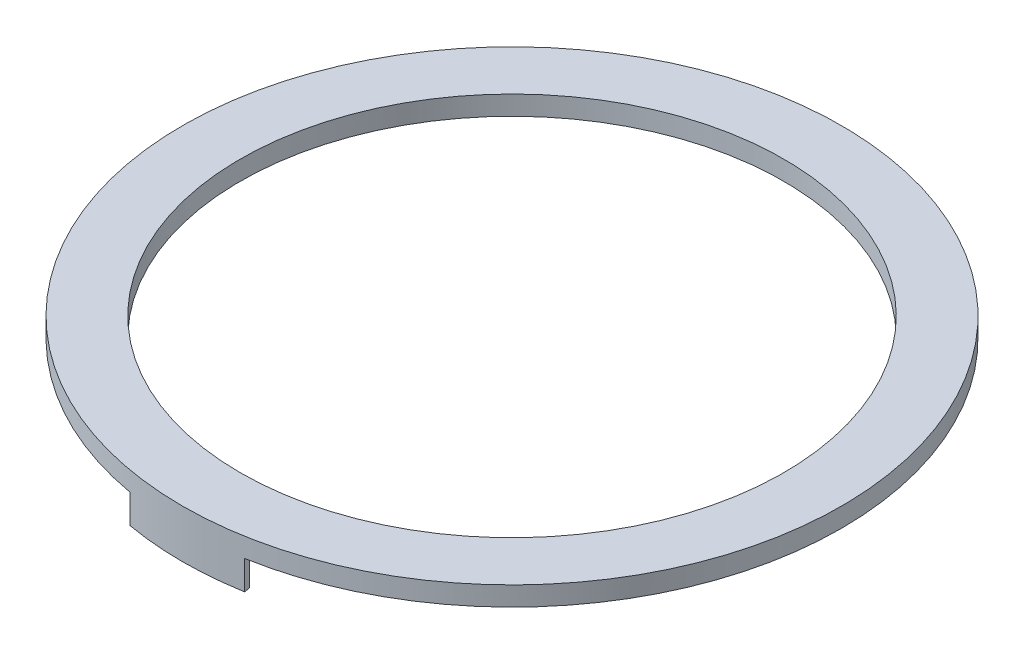
ISO-10303-21;
HEADER;
FILE_DESCRIPTION(('STEP AP214'),'2;1');
FILE_NAME('part.step','',(''),(''),'','','');
FILE_SCHEMA(('AUTOMOTIVE_DESIGN { 1 0 10303 214 1 1 1 1 }'));
ENDSEC;
DATA;
#1=APPLICATION_CONTEXT('core data for automotive mechanical design processes');
#2=APPLICATION_PROTOCOL_DEFINITION('international standard','automotive_design',2000,#1);
#3=PRODUCT_CONTEXT('',#1,'mechanical');
#4=PRODUCT('Part','Part','',(#3));
#5=PRODUCT_RELATED_PRODUCT_CATEGORY('part','',(#4));
#6=PRODUCT_DEFINITION_FORMATION('','',#4);
#7=PRODUCT_DEFINITION_CONTEXT('part definition',#1,'design');
#8=PRODUCT_DEFINITION('design','',#6,#7);
#9=PRODUCT_DEFINITION_SHAPE('','',#8);
#10=(LENGTH_UNIT() NAMED_UNIT(*) SI_UNIT(.MILLI.,.METRE.));
#11=(NAMED_UNIT(*) PLANE_ANGLE_UNIT() SI_UNIT($,.RADIAN.));
#12=(NAMED_UNIT(*) SI_UNIT($,.STERADIAN.) SOLID_ANGLE_UNIT());
#13=UNCERTAINTY_MEASURE_WITH_UNIT(LENGTH_MEASURE(1.E-05),#10,'distance_accuracy_value','');
#14=(GEOMETRIC_REPRESENTATION_CONTEXT(3) GLOBAL_UNCERTAINTY_ASSIGNED_CONTEXT((#13)) GLOBAL_UNIT_ASSIGNED_CONTEXT((#10,
#11,#12)) REPRESENTATION_CONTEXT('',''));
#15=CARTESIAN_POINT('',(0.,0.,0.));
#16=DIRECTION('',(0.,0.,1.));
#17=DIRECTION('',(1.,0.,0.));
#18=AXIS2_PLACEMENT_3D('',#15,#16,#17);
#19=CARTESIAN_POINT('',(0.,0.,0.));
#20=DIRECTION('',(0.,1.,0.));
#21=DIRECTION('',(0.,0.,1.));
#22=AXIS2_PLACEMENT_3D('',#19,#20,#21);
#23=PLANE('',#22);
#24=CARTESIAN_POINT('',(0.,0.,0.));
#25=DIRECTION('',(0.,1.,0.));
#26=DIRECTION('',(0.,0.,1.));
#27=AXIS2_PLACEMENT_3D('',#24,#25,#26);
#28=CIRCLE('',#27,141.);
#29=CARTESIAN_POINT('',(0.,0.,141.));
#30=VERTEX_POINT('',#29);
#31=EDGE_CURVE('E199',#30,#30,#28,.T.);
#32=ORIENTED_EDGE('',*,*,#31,.T.);
#33=EDGE_LOOP('',(#32));
#34=FACE_BOUND('',#33,.T.);
#35=DIRECTION('',(-0.135063024510571,0.,-0.990837009507647));
#36=VECTOR('',#35,1.);
#37=CARTESIAN_POINT('',(-29.2699838194134,0.,-165.430553548041));
#38=LINE('',#37,#36);
#39=CARTESIAN_POINT('',(-29.2699838194134,0.,-165.430553548041));
#40=VERTEX_POINT('',#39);
#41=CARTESIAN_POINT('',(-29.6754858921811,0.,-168.405360772937));
#42=VERTEX_POINT('',#41);
#43=EDGE_CURVE('E61',#40,#42,#38,.T.);
#44=ORIENTED_EDGE('',*,*,#43,.F.);
#45=CARTESIAN_POINT('',(0.,0.,0.));
#46=DIRECTION('',(0.,1.,0.));
#47=DIRECTION('',(0.,0.,1.));
#48=AXIS2_PLACEMENT_3D('',#45,#46,#47);
#49=CIRCLE('',#48,168.);
#50=CARTESIAN_POINT('',(29.1206392453004,0.,-165.456907894307));
#51=VERTEX_POINT('',#50);
#52=EDGE_CURVE('E137',#51,#40,#49,.T.);
#53=ORIENTED_EDGE('',*,*,#52,.F.);
#54=DIRECTION('',(-0.197126989575285,0.,0.980377962818925));
#55=VECTOR('',#54,1.);
#56=CARTESIAN_POINT('',(29.7121905172474,0.,-168.398888757221));
#57=LINE('',#56,#55);
#58=CARTESIAN_POINT('',(29.7121905172474,0.,-168.398888757221));
#59=VERTEX_POINT('',#58);
#60=EDGE_CURVE('E126',#59,#51,#57,.T.);
#61=ORIENTED_EDGE('',*,*,#60,.F.);
#62=CARTESIAN_POINT('',(0.,0.,0.));
#63=DIRECTION('',(0.,1.,0.));
#64=DIRECTION('',(0.,0.,1.));
#65=AXIS2_PLACEMENT_3D('',#62,#63,#64);
#66=CIRCLE('',#65,171.);
#67=CARTESIAN_POINT('',(29.6938383810537,0.,168.402125765086));
#68=VERTEX_POINT('',#67);
#69=EDGE_CURVE('E49',#68,#59,#66,.T.);
#70=ORIENTED_EDGE('',*,*,#69,.F.);
#71=DIRECTION('',(-0.173648177666982,0.,-0.984807753012199));
#72=VECTOR('',#71,1.);
#73=CARTESIAN_POINT('',(29.6938383810537,0.,168.402125765086));
#74=LINE('',#73,#72);
#75=CARTESIAN_POINT('',(29.1728938480527,0.,165.44770250605));
#76=VERTEX_POINT('',#75);
#77=EDGE_CURVE('E152',#68,#76,#74,.T.);
#78=ORIENTED_EDGE('',*,*,#77,.T.);
#79=CARTESIAN_POINT('',(0.,0.,0.));
#80=DIRECTION('',(0.,-1.,0.));
#81=DIRECTION('',(0.,0.,-1.));
#82=AXIS2_PLACEMENT_3D('',#79,#80,#81);
#83=CIRCLE('',#82,168.);
#84=CARTESIAN_POINT('',(-29.0797455051383,0.,165.464100037913));
#85=VERTEX_POINT('',#84);
#86=EDGE_CURVE('E162',#76,#85,#83,.T.);
#87=ORIENTED_EDGE('',*,*,#86,.T.);
#88=DIRECTION('',(0.216721423358504,0.,-0.976233488801457));
#89=VECTOR('',#88,1.);
#90=CARTESIAN_POINT('',(-29.730542300579,0.,168.395649749373));
#91=LINE('',#90,#89);
#92=CARTESIAN_POINT('',(-29.730542300579,0.,168.395649749373));
#93=VERTEX_POINT('',#92);
#94=EDGE_CURVE('E177',#93,#85,#91,.T.);
#95=ORIENTED_EDGE('',*,*,#94,.F.);
#96=EDGE_CURVE('E66',#42,#93,#66,.T.);
#97=ORIENTED_EDGE('',*,*,#96,.F.);
#98=EDGE_LOOP('',(#44,#53,#61,#70,#78,#87,#95,#97));
#99=FACE_BOUND('',#98,.T.);
#100=ADVANCED_FACE('F45',(#34,#99),#23,.F.);
#101=CARTESIAN_POINT('',(0.,10.,0.));
#102=DIRECTION('',(0.,-1.,0.));
#103=DIRECTION('',(0.,0.,-1.));
#104=AXIS2_PLACEMENT_3D('',#101,#102,#103);
#105=CYLINDRICAL_SURFACE('',#104,171.);
#106=CARTESIAN_POINT('',(0.,10.,0.));
#107=DIRECTION('',(0.,1.,0.));
#108=DIRECTION('',(0.,0.,1.));
#109=AXIS2_PLACEMENT_3D('',#106,#107,#108);
#110=CIRCLE('',#109,171.);
#111=CARTESIAN_POINT('',(0.,10.,171.));
#112=VERTEX_POINT('',#111);
#113=EDGE_CURVE('E11',#112,#112,#110,.T.);
#114=ORIENTED_EDGE('',*,*,#113,.F.);
#115=EDGE_LOOP('',(#114));
#116=FACE_BOUND('',#115,.T.);
#117=ORIENTED_EDGE('',*,*,#69,.T.);
#118=DIRECTION('',(0.,1.,0.));
#119=VECTOR('',#118,1.);
#120=CARTESIAN_POINT('',(29.7121905172474,-15.,-168.398888757221));
#121=LINE('',#120,#119);
#122=CARTESIAN_POINT('',(29.7121905172474,-15.,-168.398888757221));
#123=VERTEX_POINT('',#122);
#124=EDGE_CURVE('E129',#123,#59,#121,.T.);
#125=ORIENTED_EDGE('',*,*,#124,.F.);
#126=CARTESIAN_POINT('',(0.,-15.,0.));
#127=DIRECTION('',(0.,-1.,0.));
#128=DIRECTION('',(0.,0.,-1.));
#129=AXIS2_PLACEMENT_3D('',#126,#127,#128);
#130=CIRCLE('',#129,171.);
#131=CARTESIAN_POINT('',(-29.6754858921811,-15.,-168.405360772937));
#132=VERTEX_POINT('',#131);
#133=EDGE_CURVE('E116',#132,#123,#130,.T.);
#134=ORIENTED_EDGE('',*,*,#133,.F.);
#135=DIRECTION('',(0.,1.,0.));
#136=VECTOR('',#135,1.);
#137=CARTESIAN_POINT('',(-29.6754858921811,-15.,-168.405360772937));
#138=LINE('',#137,#136);
#139=EDGE_CURVE('E153',#132,#42,#138,.T.);
#140=ORIENTED_EDGE('',*,*,#139,.T.);
#141=ORIENTED_EDGE('',*,*,#96,.T.);
#142=DIRECTION('',(0.,1.,0.));
#143=VECTOR('',#142,1.);
#144=CARTESIAN_POINT('',(-29.730542300579,-15.,168.395649749373));
#145=LINE('',#144,#143);
#146=CARTESIAN_POINT('',(-29.730542300579,-15.,168.395649749373));
#147=VERTEX_POINT('',#146);
#148=EDGE_CURVE('E186',#147,#93,#145,.T.);
#149=ORIENTED_EDGE('',*,*,#148,.F.);
#150=CARTESIAN_POINT('',(0.,-15.,0.));
#151=DIRECTION('',(0.,1.,0.));
#152=DIRECTION('',(0.,0.,1.));
#153=AXIS2_PLACEMENT_3D('',#150,#151,#152);
#154=CIRCLE('',#153,171.);
#155=CARTESIAN_POINT('',(29.6938383810537,-15.,168.402125765086));
#156=VERTEX_POINT('',#155);
#157=EDGE_CURVE('E166',#147,#156,#154,.T.);
#158=ORIENTED_EDGE('',*,*,#157,.T.);
#159=DIRECTION('',(0.,1.,0.));
#160=VECTOR('',#159,1.);
#161=CARTESIAN_POINT('',(29.6938383810537,-15.,168.402125765086));
#162=LINE('',#161,#160);
#163=EDGE_CURVE('E190',#156,#68,#162,.T.);
#164=ORIENTED_EDGE('',*,*,#163,.T.);
#165=EDGE_LOOP('',(#117,#125,#134,#140,#141,#149,#158,#164));
#166=FACE_BOUND('',#165,.T.);
#167=ADVANCED_FACE('F47',(#116,#166),#105,.T.);
#168=CARTESIAN_POINT('',(0.,10.,0.));
#169=DIRECTION('',(0.,1.,0.));
#170=DIRECTION('',(0.,0.,1.));
#171=AXIS2_PLACEMENT_3D('',#168,#169,#170);
#172=PLANE('',#171);
#173=CARTESIAN_POINT('',(0.,10.,0.));
#174=DIRECTION('',(0.,1.,0.));
#175=DIRECTION('',(0.,0.,1.));
#176=AXIS2_PLACEMENT_3D('',#173,#174,#175);
#177=CIRCLE('',#176,141.);
#178=CARTESIAN_POINT('',(0.,10.,141.));
#179=VERTEX_POINT('',#178);
#180=EDGE_CURVE('E198',#179,#179,#177,.T.);
#181=ORIENTED_EDGE('',*,*,#180,.F.);
#182=EDGE_LOOP('',(#181));
#183=FACE_BOUND('',#182,.T.);
#184=ORIENTED_EDGE('',*,*,#113,.T.);
#185=EDGE_LOOP('',(#184));
#186=FACE_BOUND('',#185,.T.);
#187=ADVANCED_FACE('F209',(#183,#186),#172,.T.);
#188=CARTESIAN_POINT('',(0.,0.,0.));
#189=DIRECTION('',(0.,1.,0.));
#190=DIRECTION('',(0.,0.,1.));
#191=AXIS2_PLACEMENT_3D('',#188,#189,#190);
#192=CYLINDRICAL_SURFACE('',#191,141.);
#193=ORIENTED_EDGE('',*,*,#31,.F.);
#194=EDGE_LOOP('',(#193));
#195=FACE_BOUND('',#194,.T.);
#196=ORIENTED_EDGE('',*,*,#180,.T.);
#197=EDGE_LOOP('',(#196));
#198=FACE_BOUND('',#197,.T.);
#199=ADVANCED_FACE('F207',(#195,#198),#192,.F.);
#200=CARTESIAN_POINT('',(29.6938383810537,-15.,168.402125765086));
#201=DIRECTION('',(0.984807753012199,0.,-0.173648177666982));
#202=DIRECTION('',(-0.173648177666982,0.,-0.984807753012199));
#203=AXIS2_PLACEMENT_3D('',#200,#201,#202);
#204=PLANE('',#203);
#205=ORIENTED_EDGE('',*,*,#77,.F.);
#206=ORIENTED_EDGE('',*,*,#163,.F.);
#207=DIRECTION('',(-0.173648177666982,0.,-0.984807753012199));
#208=VECTOR('',#207,1.);
#209=CARTESIAN_POINT('',(29.6938383810537,-15.,168.402125765086));
#210=LINE('',#209,#208);
#211=CARTESIAN_POINT('',(29.1728938480527,-15.,165.44770250605));
#212=VERTEX_POINT('',#211);
#213=EDGE_CURVE('E161',#156,#212,#210,.T.);
#214=ORIENTED_EDGE('',*,*,#213,.T.);
#215=DIRECTION('',(0.,1.,0.));
#216=VECTOR('',#215,1.);
#217=CARTESIAN_POINT('',(29.1728938480527,-15.,165.44770250605));
#218=LINE('',#217,#216);
#219=EDGE_CURVE('E194',#212,#76,#218,.T.);
#220=ORIENTED_EDGE('',*,*,#219,.T.);
#221=EDGE_LOOP('',(#205,#206,#214,#220));
#222=FACE_BOUND('',#221,.T.);
#223=ADVANCED_FACE('F233',(#222),#204,.T.);
#224=CARTESIAN_POINT('',(-29.730542300579,-15.,168.395649749373));
#225=DIRECTION('',(0.976233488801457,0.,0.216721423358504));
#226=DIRECTION('',(0.216721423358504,0.,-0.976233488801457));
#227=AXIS2_PLACEMENT_3D('',#224,#225,#226);
#228=PLANE('',#227);
#229=ORIENTED_EDGE('',*,*,#94,.T.);
#230=DIRECTION('',(0.,1.,0.));
#231=VECTOR('',#230,1.);
#232=CARTESIAN_POINT('',(-29.0797455051383,-15.,165.464100037913));
#233=LINE('',#232,#231);
#234=CARTESIAN_POINT('',(-29.0797455051383,-15.,165.464100037913));
#235=VERTEX_POINT('',#234);
#236=EDGE_CURVE('E174',#235,#85,#233,.T.);
#237=ORIENTED_EDGE('',*,*,#236,.F.);
#238=DIRECTION('',(0.216721423358504,0.,-0.976233488801457));
#239=VECTOR('',#238,1.);
#240=CARTESIAN_POINT('',(-29.730542300579,-15.,168.395649749373));
#241=LINE('',#240,#239);
#242=EDGE_CURVE('E170',#147,#235,#241,.T.);
#243=ORIENTED_EDGE('',*,*,#242,.F.);
#244=ORIENTED_EDGE('',*,*,#148,.T.);
#245=EDGE_LOOP('',(#229,#237,#243,#244));
#246=FACE_BOUND('',#245,.T.);
#247=ADVANCED_FACE('F227',(#246),#228,.F.);
#248=CARTESIAN_POINT('',(0.,-15.,0.));
#249=DIRECTION('',(0.,1.,0.));
#250=DIRECTION('',(0.,0.,1.));
#251=AXIS2_PLACEMENT_3D('',#248,#249,#250);
#252=CYLINDRICAL_SURFACE('',#251,168.);
#253=ORIENTED_EDGE('',*,*,#86,.F.);
#254=ORIENTED_EDGE('',*,*,#219,.F.);
#255=CARTESIAN_POINT('',(0.,-15.,0.));
#256=DIRECTION('',(0.,1.,0.));
#257=DIRECTION('',(0.,0.,1.));
#258=AXIS2_PLACEMENT_3D('',#255,#256,#257);
#259=CIRCLE('',#258,168.);
#260=EDGE_CURVE('E158',#235,#212,#259,.T.);
#261=ORIENTED_EDGE('',*,*,#260,.F.);
#262=ORIENTED_EDGE('',*,*,#236,.T.);
#263=EDGE_LOOP('',(#253,#254,#261,#262));
#264=FACE_BOUND('',#263,.T.);
#265=ADVANCED_FACE('F235',(#264),#252,.F.);
#266=CARTESIAN_POINT('',(0.,-15.,0.));
#267=DIRECTION('',(0.,1.,0.));
#268=DIRECTION('',(0.,0.,1.));
#269=AXIS2_PLACEMENT_3D('',#266,#267,#268);
#270=PLANE('',#269);
#271=ORIENTED_EDGE('',*,*,#260,.T.);
#272=ORIENTED_EDGE('',*,*,#213,.F.);
#273=ORIENTED_EDGE('',*,*,#157,.F.);
#274=ORIENTED_EDGE('',*,*,#242,.T.);
#275=EDGE_LOOP('',(#271,#272,#273,#274));
#276=FACE_BOUND('',#275,.T.);
#277=ADVANCED_FACE('F229',(#276),#270,.F.);
#278=CARTESIAN_POINT('',(0.,-15.,0.));
#279=DIRECTION('',(0.,1.,0.));
#280=DIRECTION('',(0.,0.,1.));
#281=AXIS2_PLACEMENT_3D('',#278,#279,#280);
#282=CYLINDRICAL_SURFACE('',#281,168.);
#283=ORIENTED_EDGE('',*,*,#52,.T.);
#284=DIRECTION('',(0.,1.,0.));
#285=VECTOR('',#284,1.);
#286=CARTESIAN_POINT('',(-29.2699838194134,-15.,-165.430553548041));
#287=LINE('',#286,#285);
#288=CARTESIAN_POINT('',(-29.2699838194134,-15.,-165.430553548041));
#289=VERTEX_POINT('',#288);
#290=EDGE_CURVE('E134',#289,#40,#287,.T.);
#291=ORIENTED_EDGE('',*,*,#290,.F.);
#292=CARTESIAN_POINT('',(0.,-15.,0.));
#293=DIRECTION('',(0.,-1.,0.));
#294=DIRECTION('',(0.,0.,-1.));
#295=AXIS2_PLACEMENT_3D('',#292,#293,#294);
#296=CIRCLE('',#295,168.);
#297=CARTESIAN_POINT('',(29.1206392453004,-15.,-165.456907894307));
#298=VERTEX_POINT('',#297);
#299=EDGE_CURVE('E114',#289,#298,#296,.T.);
#300=ORIENTED_EDGE('',*,*,#299,.T.);
#301=DIRECTION('',(0.,1.,0.));
#302=VECTOR('',#301,1.);
#303=CARTESIAN_POINT('',(29.1206392453004,-15.,-165.456907894307));
#304=LINE('',#303,#302);
#305=EDGE_CURVE('E124',#298,#51,#304,.T.);
#306=ORIENTED_EDGE('',*,*,#305,.T.);
#307=EDGE_LOOP('',(#283,#291,#300,#306));
#308=FACE_BOUND('',#307,.T.);
#309=ADVANCED_FACE('F132',(#308),#282,.F.);
#310=CARTESIAN_POINT('',(-29.2699838194134,-15.,-165.430553548041));
#311=DIRECTION('',(0.990837009507647,0.,-0.135063024510571));
#312=DIRECTION('',(-0.135063024510571,0.,-0.990837009507647));
#313=AXIS2_PLACEMENT_3D('',#310,#311,#312);
#314=PLANE('',#313);
#315=ORIENTED_EDGE('',*,*,#43,.T.);
#316=ORIENTED_EDGE('',*,*,#139,.F.);
#317=DIRECTION('',(-0.135063024510571,0.,-0.990837009507647));
#318=VECTOR('',#317,1.);
#319=CARTESIAN_POINT('',(-29.2699838194134,-15.,-165.430553548041));
#320=LINE('',#319,#318);
#321=EDGE_CURVE('E130',#289,#132,#320,.T.);
#322=ORIENTED_EDGE('',*,*,#321,.F.);
#323=ORIENTED_EDGE('',*,*,#290,.T.);
#324=EDGE_LOOP('',(#315,#316,#322,#323));
#325=FACE_BOUND('',#324,.T.);
#326=ADVANCED_FACE('F300',(#325),#314,.F.);
#327=CARTESIAN_POINT('',(29.7121905172474,-15.,-168.398888757221));
#328=DIRECTION('',(-0.980377962818925,0.,-0.197126989575285));
#329=DIRECTION('',(-0.197126989575285,0.,0.980377962818925));
#330=AXIS2_PLACEMENT_3D('',#327,#328,#329);
#331=PLANE('',#330);
#332=ORIENTED_EDGE('',*,*,#60,.T.);
#333=ORIENTED_EDGE('',*,*,#305,.F.);
#334=DIRECTION('',(-0.197126989575285,0.,0.980377962818925));
#335=VECTOR('',#334,1.);
#336=CARTESIAN_POINT('',(29.7121905172474,-15.,-168.398888757221));
#337=LINE('',#336,#335);
#338=EDGE_CURVE('E109',#123,#298,#337,.T.);
#339=ORIENTED_EDGE('',*,*,#338,.F.);
#340=ORIENTED_EDGE('',*,*,#124,.T.);
#341=EDGE_LOOP('',(#332,#333,#339,#340));
#342=FACE_BOUND('',#341,.T.);
#343=ADVANCED_FACE('F125',(#342),#331,.F.);
#344=CARTESIAN_POINT('',(0.,-15.,0.));
#345=DIRECTION('',(0.,-1.,0.));
#346=DIRECTION('',(0.,0.,-1.));
#347=AXIS2_PLACEMENT_3D('',#344,#345,#346);
#348=PLANE('',#347);
#349=ORIENTED_EDGE('',*,*,#299,.F.);
#350=ORIENTED_EDGE('',*,*,#321,.T.);
#351=ORIENTED_EDGE('',*,*,#133,.T.);
#352=ORIENTED_EDGE('',*,*,#338,.T.);
#353=EDGE_LOOP('',(#349,#350,#351,#352));
#354=FACE_BOUND('',#353,.T.);
#355=ADVANCED_FACE('F111',(#354),#348,.T.);
#356=CLOSED_SHELL('',(#100,#167,#187,#199,#223,#247,#265,#277,#309,#326,#343,#355));
#357=MANIFOLD_SOLID_BREP('B2',#356);
#358=ADVANCED_BREP_SHAPE_REPRESENTATION('',(#18,#357),#14);
#359=SHAPE_DEFINITION_REPRESENTATION(#9,#358);
ENDSEC;
END-ISO-10303-21;
